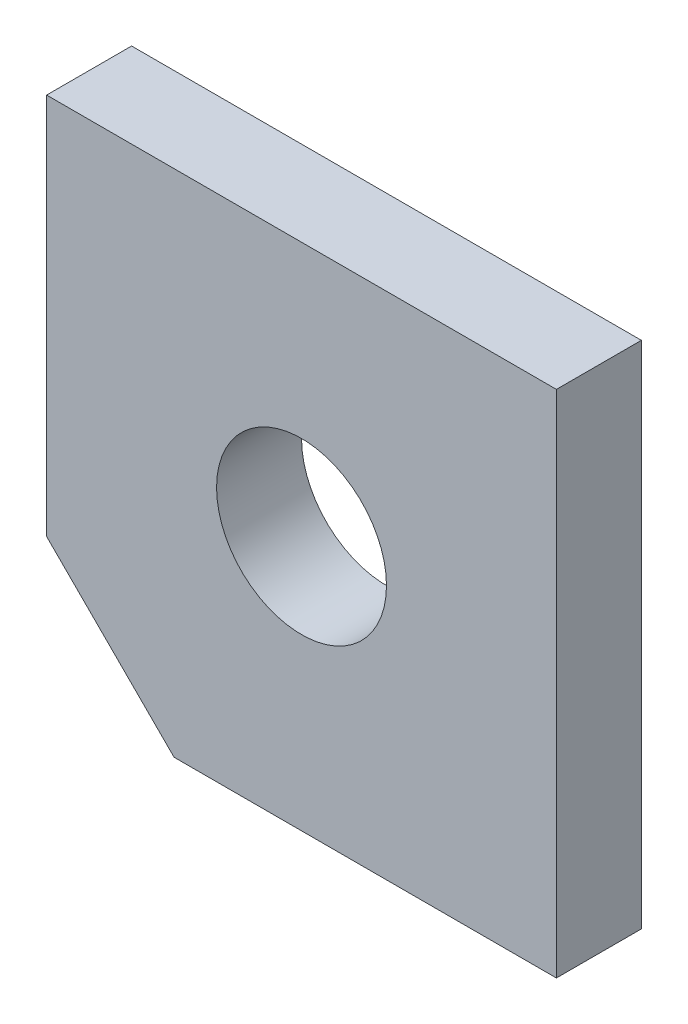
ISO-10303-21;
HEADER;
FILE_DESCRIPTION(('STEP AP214'),'2;1');
FILE_NAME('part.step','',(''),(''),'','','');
FILE_SCHEMA(('AUTOMOTIVE_DESIGN { 1 0 10303 214 1 1 1 1 }'));
ENDSEC;
DATA;
#1=APPLICATION_CONTEXT('core data for automotive mechanical design processes');
#2=APPLICATION_PROTOCOL_DEFINITION('international standard','automotive_design',2000,#1);
#3=PRODUCT_CONTEXT('',#1,'mechanical');
#4=PRODUCT('Part','Part','',(#3));
#5=PRODUCT_RELATED_PRODUCT_CATEGORY('part','',(#4));
#6=PRODUCT_DEFINITION_FORMATION('','',#4);
#7=PRODUCT_DEFINITION_CONTEXT('part definition',#1,'design');
#8=PRODUCT_DEFINITION('design','',#6,#7);
#9=PRODUCT_DEFINITION_SHAPE('','',#8);
#10=(LENGTH_UNIT() NAMED_UNIT(*) SI_UNIT(.MILLI.,.METRE.));
#11=(NAMED_UNIT(*) PLANE_ANGLE_UNIT() SI_UNIT($,.RADIAN.));
#12=(NAMED_UNIT(*) SI_UNIT($,.STERADIAN.) SOLID_ANGLE_UNIT());
#13=UNCERTAINTY_MEASURE_WITH_UNIT(LENGTH_MEASURE(1.E-05),#10,'distance_accuracy_value','');
#14=(GEOMETRIC_REPRESENTATION_CONTEXT(3) GLOBAL_UNCERTAINTY_ASSIGNED_CONTEXT((#13)) GLOBAL_UNIT_ASSIGNED_CONTEXT((#10,
#11,#12)) REPRESENTATION_CONTEXT('',''));
#15=CARTESIAN_POINT('',(0.,0.,0.));
#16=DIRECTION('',(0.,0.,1.));
#17=DIRECTION('',(1.,0.,0.));
#18=AXIS2_PLACEMENT_3D('',#15,#16,#17);
#19=CARTESIAN_POINT('',(0.,76.2,12.7));
#20=DIRECTION('',(0.,0.,1.));
#21=DIRECTION('',(1.,0.,0.));
#22=AXIS2_PLACEMENT_3D('',#19,#20,#21);
#23=PLANE('',#22);
#24=DIRECTION('',(0.,-1.,0.));
#25=VECTOR('',#24,1.);
#26=CARTESIAN_POINT('',(-76.2,0.,12.7));
#27=LINE('',#26,#25);
#28=CARTESIAN_POINT('',(-76.2,76.2,12.7));
#29=VERTEX_POINT('',#28);
#30=CARTESIAN_POINT('',(-76.2,19.05,12.7));
#31=VERTEX_POINT('',#30);
#32=EDGE_CURVE('E73',#29,#31,#27,.T.);
#33=ORIENTED_EDGE('',*,*,#32,.T.);
#34=DIRECTION('',(-0.707106781186546,0.707106781186549,0.));
#35=VECTOR('',#34,1.);
#36=CARTESIAN_POINT('',(-66.675,9.52500000000014,12.7));
#37=LINE('',#36,#35);
#38=CARTESIAN_POINT('',(-57.15,0.,12.7));
#39=VERTEX_POINT('',#38);
#40=EDGE_CURVE('E11',#31,#39,#37,.F.);
#41=ORIENTED_EDGE('',*,*,#40,.T.);
#42=DIRECTION('',(1.,0.,0.));
#43=VECTOR('',#42,1.);
#44=CARTESIAN_POINT('',(0.,0.,12.7));
#45=LINE('',#44,#43);
#46=CARTESIAN_POINT('',(0.,0.,12.7));
#47=VERTEX_POINT('',#46);
#48=EDGE_CURVE('E79',#39,#47,#45,.T.);
#49=ORIENTED_EDGE('',*,*,#48,.T.);
#50=DIRECTION('',(0.,1.,0.));
#51=VECTOR('',#50,1.);
#52=CARTESIAN_POINT('',(0.,0.,12.7));
#53=LINE('',#52,#51);
#54=CARTESIAN_POINT('',(0.,76.2,12.7));
#55=VERTEX_POINT('',#54);
#56=EDGE_CURVE('E74',#47,#55,#53,.T.);
#57=ORIENTED_EDGE('',*,*,#56,.T.);
#58=DIRECTION('',(-1.,0.,0.));
#59=VECTOR('',#58,1.);
#60=CARTESIAN_POINT('',(0.,76.2,12.7));
#61=LINE('',#60,#59);
#62=EDGE_CURVE('E64',#55,#29,#61,.T.);
#63=ORIENTED_EDGE('',*,*,#62,.T.);
#64=EDGE_LOOP('',(#33,#41,#49,#57,#63));
#65=FACE_BOUND('',#64,.T.);
#66=CARTESIAN_POINT('',(-38.1,38.1,12.7));
#67=DIRECTION('',(0.,0.,1.));
#68=DIRECTION('',(1.,0.,0.));
#69=AXIS2_PLACEMENT_3D('',#66,#67,#68);
#70=CIRCLE('',#69,12.7);
#71=CARTESIAN_POINT('',(-25.4,38.1,12.7));
#72=VERTEX_POINT('',#71);
#73=EDGE_CURVE('E103',#72,#72,#70,.T.);
#74=ORIENTED_EDGE('',*,*,#73,.F.);
#75=EDGE_LOOP('',(#74));
#76=FACE_BOUND('',#75,.T.);
#77=ADVANCED_FACE('F17',(#65,#76),#23,.T.);
#78=CARTESIAN_POINT('',(0.,76.2,0.));
#79=DIRECTION('',(0.,0.,1.));
#80=DIRECTION('',(1.,0.,0.));
#81=AXIS2_PLACEMENT_3D('',#78,#79,#80);
#82=PLANE('',#81);
#83=DIRECTION('',(1.,0.,0.));
#84=VECTOR('',#83,1.);
#85=CARTESIAN_POINT('',(0.,0.,0.));
#86=LINE('',#85,#84);
#87=CARTESIAN_POINT('',(-57.15,0.,0.));
#88=VERTEX_POINT('',#87);
#89=CARTESIAN_POINT('',(0.,0.,0.));
#90=VERTEX_POINT('',#89);
#91=EDGE_CURVE('E83',#88,#90,#86,.T.);
#92=ORIENTED_EDGE('',*,*,#91,.F.);
#93=DIRECTION('',(0.707106781186546,-0.707106781186549,0.));
#94=VECTOR('',#93,1.);
#95=CARTESIAN_POINT('',(-57.15,0.,0.));
#96=LINE('',#95,#94);
#97=CARTESIAN_POINT('',(-76.2,19.05,0.));
#98=VERTEX_POINT('',#97);
#99=EDGE_CURVE('E39',#88,#98,#96,.F.);
#100=ORIENTED_EDGE('',*,*,#99,.T.);
#101=DIRECTION('',(0.,-1.,0.));
#102=VECTOR('',#101,1.);
#103=CARTESIAN_POINT('',(-76.2,0.,0.));
#104=LINE('',#103,#102);
#105=CARTESIAN_POINT('',(-76.2,76.2,0.));
#106=VERTEX_POINT('',#105);
#107=EDGE_CURVE('E98',#106,#98,#104,.T.);
#108=ORIENTED_EDGE('',*,*,#107,.F.);
#109=DIRECTION('',(-1.,0.,0.));
#110=VECTOR('',#109,1.);
#111=CARTESIAN_POINT('',(0.,76.2,0.));
#112=LINE('',#111,#110);
#113=CARTESIAN_POINT('',(0.,76.2,0.));
#114=VERTEX_POINT('',#113);
#115=EDGE_CURVE('E100',#114,#106,#112,.T.);
#116=ORIENTED_EDGE('',*,*,#115,.F.);
#117=DIRECTION('',(0.,1.,0.));
#118=VECTOR('',#117,1.);
#119=CARTESIAN_POINT('',(0.,0.,0.));
#120=LINE('',#119,#118);
#121=EDGE_CURVE('E87',#90,#114,#120,.T.);
#122=ORIENTED_EDGE('',*,*,#121,.F.);
#123=EDGE_LOOP('',(#92,#100,#108,#116,#122));
#124=FACE_BOUND('',#123,.T.);
#125=CARTESIAN_POINT('',(-38.1,38.1,0.));
#126=DIRECTION('',(0.,0.,1.));
#127=DIRECTION('',(1.,0.,0.));
#128=AXIS2_PLACEMENT_3D('',#125,#126,#127);
#129=CIRCLE('',#128,12.7);
#130=CARTESIAN_POINT('',(-25.4,38.1,0.));
#131=VERTEX_POINT('',#130);
#132=EDGE_CURVE('E106',#131,#131,#129,.T.);
#133=ORIENTED_EDGE('',*,*,#132,.T.);
#134=EDGE_LOOP('',(#133));
#135=FACE_BOUND('',#134,.T.);
#136=ADVANCED_FACE('F115',(#124,#135),#82,.F.);
#137=CARTESIAN_POINT('',(0.,0.,12.7));
#138=DIRECTION('',(-1.,0.,0.));
#139=DIRECTION('',(0.,0.,1.));
#140=AXIS2_PLACEMENT_3D('',#137,#138,#139);
#141=PLANE('',#140);
#142=ORIENTED_EDGE('',*,*,#121,.T.);
#143=DIRECTION('',(0.,0.,-1.));
#144=VECTOR('',#143,1.);
#145=CARTESIAN_POINT('',(0.,76.2,12.7));
#146=LINE('',#145,#144);
#147=EDGE_CURVE('E68',#55,#114,#146,.T.);
#148=ORIENTED_EDGE('',*,*,#147,.F.);
#149=ORIENTED_EDGE('',*,*,#56,.F.);
#150=DIRECTION('',(0.,0.,-1.));
#151=VECTOR('',#150,1.);
#152=CARTESIAN_POINT('',(0.,0.,12.7));
#153=LINE('',#152,#151);
#154=EDGE_CURVE('E92',#47,#90,#153,.T.);
#155=ORIENTED_EDGE('',*,*,#154,.T.);
#156=EDGE_LOOP('',(#142,#148,#149,#155));
#157=FACE_BOUND('',#156,.T.);
#158=ADVANCED_FACE('F85',(#157),#141,.F.);
#159=CARTESIAN_POINT('',(0.,76.2,12.7));
#160=DIRECTION('',(0.,-1.,0.));
#161=DIRECTION('',(0.,0.,-1.));
#162=AXIS2_PLACEMENT_3D('',#159,#160,#161);
#163=PLANE('',#162);
#164=ORIENTED_EDGE('',*,*,#115,.T.);
#165=DIRECTION('',(0.,0.,-1.));
#166=VECTOR('',#165,1.);
#167=CARTESIAN_POINT('',(-76.2,76.2,12.7));
#168=LINE('',#167,#166);
#169=EDGE_CURVE('E71',#29,#106,#168,.T.);
#170=ORIENTED_EDGE('',*,*,#169,.F.);
#171=ORIENTED_EDGE('',*,*,#62,.F.);
#172=ORIENTED_EDGE('',*,*,#147,.T.);
#173=EDGE_LOOP('',(#164,#170,#171,#172));
#174=FACE_BOUND('',#173,.T.);
#175=ADVANCED_FACE('F66',(#174),#163,.F.);
#176=CARTESIAN_POINT('',(-76.2,0.,12.7));
#177=DIRECTION('',(1.,0.,0.));
#178=DIRECTION('',(0.,1.,0.));
#179=AXIS2_PLACEMENT_3D('',#176,#177,#178);
#180=PLANE('',#179);
#181=ORIENTED_EDGE('',*,*,#107,.T.);
#182=DIRECTION('',(0.,0.,1.));
#183=VECTOR('',#182,1.);
#184=CARTESIAN_POINT('',(-76.2,19.05,12.7));
#185=LINE('',#184,#183);
#186=EDGE_CURVE('E25',#98,#31,#185,.T.);
#187=ORIENTED_EDGE('',*,*,#186,.T.);
#188=ORIENTED_EDGE('',*,*,#32,.F.);
#189=ORIENTED_EDGE('',*,*,#169,.T.);
#190=EDGE_LOOP('',(#181,#187,#188,#189));
#191=FACE_BOUND('',#190,.T.);
#192=ADVANCED_FACE('F128',(#191),#180,.F.);
#193=CARTESIAN_POINT('',(0.,0.,12.7));
#194=DIRECTION('',(0.,1.,0.));
#195=DIRECTION('',(-1.,0.,0.));
#196=AXIS2_PLACEMENT_3D('',#193,#194,#195);
#197=PLANE('',#196);
#198=ORIENTED_EDGE('',*,*,#48,.F.);
#199=DIRECTION('',(0.,0.,-1.));
#200=VECTOR('',#199,1.);
#201=CARTESIAN_POINT('',(-57.15,0.,12.7));
#202=LINE('',#201,#200);
#203=EDGE_CURVE('E88',#39,#88,#202,.T.);
#204=ORIENTED_EDGE('',*,*,#203,.T.);
#205=ORIENTED_EDGE('',*,*,#91,.T.);
#206=ORIENTED_EDGE('',*,*,#154,.F.);
#207=EDGE_LOOP('',(#198,#204,#205,#206));
#208=FACE_BOUND('',#207,.T.);
#209=ADVANCED_FACE('F125',(#208),#197,.F.);
#210=CARTESIAN_POINT('',(-38.1,38.1,12.7));
#211=DIRECTION('',(0.,0.,-1.));
#212=DIRECTION('',(-1.,0.,0.));
#213=AXIS2_PLACEMENT_3D('',#210,#211,#212);
#214=CYLINDRICAL_SURFACE('',#213,12.7);
#215=ORIENTED_EDGE('',*,*,#73,.T.);
#216=EDGE_LOOP('',(#215));
#217=FACE_BOUND('',#216,.T.);
#218=ORIENTED_EDGE('',*,*,#132,.F.);
#219=EDGE_LOOP('',(#218));
#220=FACE_BOUND('',#219,.T.);
#221=ADVANCED_FACE('F112',(#217,#220),#214,.F.);
#222=CARTESIAN_POINT('',(-57.15,0.,12.7));
#223=DIRECTION('',(0.707106781186549,0.707106781186546,0.));
#224=DIRECTION('',(-0.707106781186546,0.707106781186549,0.));
#225=AXIS2_PLACEMENT_3D('',#222,#223,#224);
#226=PLANE('',#225);
#227=ORIENTED_EDGE('',*,*,#40,.F.);
#228=ORIENTED_EDGE('',*,*,#186,.F.);
#229=ORIENTED_EDGE('',*,*,#99,.F.);
#230=ORIENTED_EDGE('',*,*,#203,.F.);
#231=EDGE_LOOP('',(#227,#228,#229,#230));
#232=FACE_BOUND('',#231,.T.);
#233=ADVANCED_FACE('F19',(#232),#226,.F.);
#234=CLOSED_SHELL('',(#77,#136,#158,#175,#192,#209,#221,#233));
#235=MANIFOLD_SOLID_BREP('B1',#234);
#236=ADVANCED_BREP_SHAPE_REPRESENTATION('',(#18,#235),#14);
#237=SHAPE_DEFINITION_REPRESENTATION(#9,#236);
ENDSEC;
END-ISO-10303-21;
